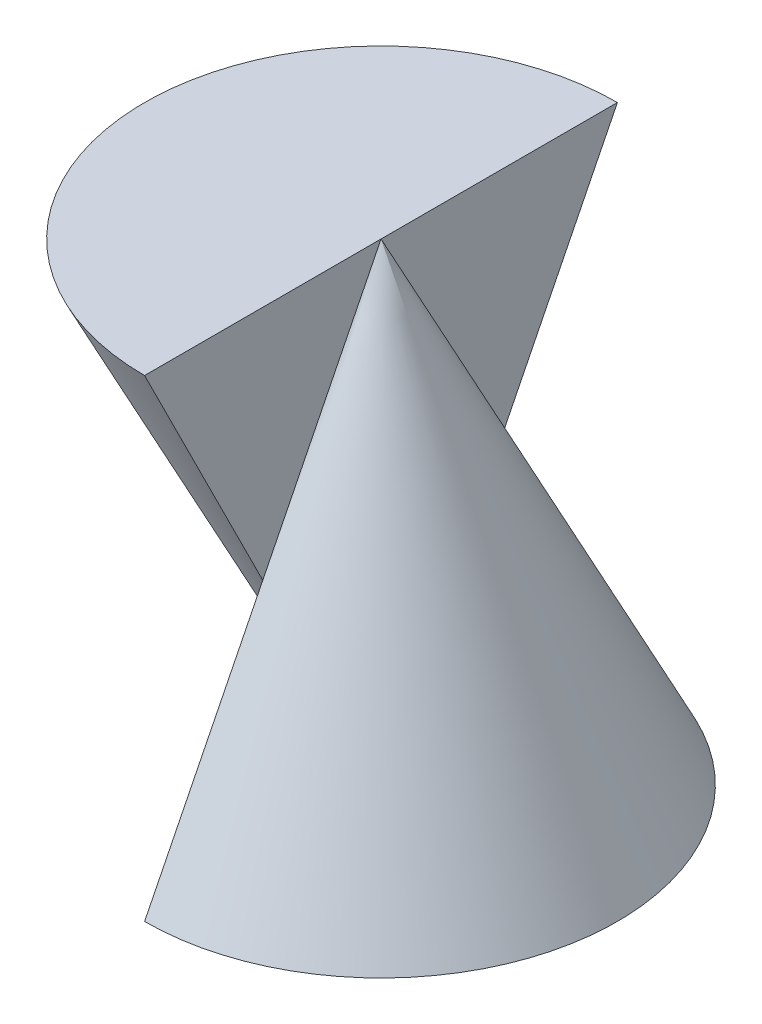
ISO-10303-21;
HEADER;
FILE_DESCRIPTION(('STEP AP214'),'2;1');
FILE_NAME('part.step','',(''),(''),'','','');
FILE_SCHEMA(('AUTOMOTIVE_DESIGN { 1 0 10303 214 1 1 1 1 }'));
ENDSEC;
DATA;
#1=APPLICATION_CONTEXT('core data for automotive mechanical design processes');
#2=APPLICATION_PROTOCOL_DEFINITION('international standard','automotive_design',2000,#1);
#3=PRODUCT_CONTEXT('',#1,'mechanical');
#4=PRODUCT('Part','Part','',(#3));
#5=PRODUCT_RELATED_PRODUCT_CATEGORY('part','',(#4));
#6=PRODUCT_DEFINITION_FORMATION('','',#4);
#7=PRODUCT_DEFINITION_CONTEXT('part definition',#1,'design');
#8=PRODUCT_DEFINITION('design','',#6,#7);
#9=PRODUCT_DEFINITION_SHAPE('','',#8);
#10=(LENGTH_UNIT() NAMED_UNIT(*) SI_UNIT(.MILLI.,.METRE.));
#11=(NAMED_UNIT(*) PLANE_ANGLE_UNIT() SI_UNIT($,.RADIAN.));
#12=(NAMED_UNIT(*) SI_UNIT($,.STERADIAN.) SOLID_ANGLE_UNIT());
#13=UNCERTAINTY_MEASURE_WITH_UNIT(LENGTH_MEASURE(1.E-05),#10,'distance_accuracy_value','');
#14=(GEOMETRIC_REPRESENTATION_CONTEXT(3) GLOBAL_UNCERTAINTY_ASSIGNED_CONTEXT((#13)) GLOBAL_UNIT_ASSIGNED_CONTEXT((#10,
#11,#12)) REPRESENTATION_CONTEXT('',''));
#15=CARTESIAN_POINT('',(0.,0.,0.));
#16=DIRECTION('',(0.,0.,1.));
#17=DIRECTION('',(1.,0.,0.));
#18=AXIS2_PLACEMENT_3D('',#15,#16,#17);
#19=CARTESIAN_POINT('',(0.,0.,0.));
#20=DIRECTION('',(-1.,0.,0.));
#21=DIRECTION('',(0.,0.,1.));
#22=AXIS2_PLACEMENT_3D('',#19,#20,#21);
#23=PLANE('',#22);
#24=DIRECTION('',(0.,-0.894427190999916,0.447213595499958));
#25=VECTOR('',#24,1.);
#26=CARTESIAN_POINT('',(0.,4.,0.));
#27=LINE('',#26,#25);
#28=CARTESIAN_POINT('',(0.,2.,1.));
#29=VERTEX_POINT('',#28);
#30=CARTESIAN_POINT('',(0.,0.,2.));
#31=VERTEX_POINT('',#30);
#32=EDGE_CURVE('E96',#29,#31,#27,.T.);
#33=ORIENTED_EDGE('',*,*,#32,.F.);
#34=DIRECTION('',(0.,0.894427190999916,0.447213595499958));
#35=VECTOR('',#34,1.);
#36=CARTESIAN_POINT('',(0.,4.,2.));
#37=LINE('',#36,#35);
#38=CARTESIAN_POINT('',(0.,0.,0.));
#39=VERTEX_POINT('',#38);
#40=EDGE_CURVE('E92',#39,#29,#37,.T.);
#41=ORIENTED_EDGE('',*,*,#40,.F.);
#42=DIRECTION('',(0.,0.,1.));
#43=VECTOR('',#42,1.);
#44=CARTESIAN_POINT('',(0.,0.,-2.));
#45=LINE('',#44,#43);
#46=EDGE_CURVE('E102',#39,#31,#45,.T.);
#47=ORIENTED_EDGE('',*,*,#46,.T.);
#48=EDGE_LOOP('',(#33,#41,#47));
#49=FACE_BOUND('',#48,.T.);
#50=ADVANCED_FACE('F33',(#49),#23,.T.);
#51=CARTESIAN_POINT('',(0.,0.,-2.));
#52=VERTEX_POINT('',#51);
#53=EDGE_CURVE('E41',#52,#39,#45,.T.);
#54=ORIENTED_EDGE('',*,*,#53,.T.);
#55=DIRECTION('',(0.,0.894427190999916,-0.447213595499958));
#56=VECTOR('',#55,1.);
#57=CARTESIAN_POINT('',(0.,4.,-2.));
#58=LINE('',#57,#56);
#59=CARTESIAN_POINT('',(0.,2.,-1.));
#60=VERTEX_POINT('',#59);
#61=EDGE_CURVE('E87',#39,#60,#58,.T.);
#62=ORIENTED_EDGE('',*,*,#61,.T.);
#63=DIRECTION('',(0.,-0.894427190999916,-0.447213595499958));
#64=VECTOR('',#63,1.);
#65=CARTESIAN_POINT('',(0.,4.,0.));
#66=LINE('',#65,#64);
#67=EDGE_CURVE('E56',#60,#52,#66,.T.);
#68=ORIENTED_EDGE('',*,*,#67,.T.);
#69=EDGE_LOOP('',(#54,#62,#68));
#70=FACE_BOUND('',#69,.T.);
#71=ADVANCED_FACE('F113',(#70),#23,.T.);
#72=CARTESIAN_POINT('',(0.,4.,0.));
#73=DIRECTION('',(0.,-1.,0.));
#74=DIRECTION('',(0.,0.,-1.));
#75=AXIS2_PLACEMENT_3D('',#72,#73,#74);
#76=CONICAL_SURFACE('',#75,0.,0.463647609000806);
#77=CARTESIAN_POINT('',(0.,0.,0.));
#78=DIRECTION('',(0.,-1.,0.));
#79=DIRECTION('',(0.,0.,-1.));
#80=AXIS2_PLACEMENT_3D('',#77,#78,#79);
#81=CIRCLE('',#80,2.);
#82=EDGE_CURVE('E11',#52,#31,#81,.T.);
#83=ORIENTED_EDGE('',*,*,#82,.F.);
#84=ORIENTED_EDGE('',*,*,#67,.F.);
#85=CARTESIAN_POINT('',(0.,4.,0.));
#86=VERTEX_POINT('',#85);
#87=EDGE_CURVE('E101',#86,#60,#66,.T.);
#88=ORIENTED_EDGE('',*,*,#87,.F.);
#89=EDGE_CURVE('E81',#86,#29,#27,.T.);
#90=ORIENTED_EDGE('',*,*,#89,.T.);
#91=ORIENTED_EDGE('',*,*,#32,.T.);
#92=EDGE_LOOP('',(#83,#84,#88,#90,#91));
#93=FACE_BOUND('',#92,.T.);
#94=ADVANCED_FACE('F35',(#93),#76,.T.);
#95=CARTESIAN_POINT('',(0.,0.,-2.));
#96=DIRECTION('',(0.,1.,0.));
#97=DIRECTION('',(0.,0.,1.));
#98=AXIS2_PLACEMENT_3D('',#95,#96,#97);
#99=PLANE('',#98);
#100=ORIENTED_EDGE('',*,*,#53,.F.);
#101=ORIENTED_EDGE('',*,*,#82,.T.);
#102=ORIENTED_EDGE('',*,*,#46,.F.);
#103=EDGE_LOOP('',(#100,#101,#102));
#104=FACE_BOUND('',#103,.T.);
#105=ADVANCED_FACE('F108',(#104),#99,.F.);
#106=CARTESIAN_POINT('',(0.,0.,0.));
#107=DIRECTION('',(-1.,0.,0.));
#108=DIRECTION('',(0.,0.,1.));
#109=AXIS2_PLACEMENT_3D('',#106,#107,#108);
#110=PLANE('',#109);
#111=DIRECTION('',(0.,0.,1.));
#112=VECTOR('',#111,1.);
#113=CARTESIAN_POINT('',(0.,4.,0.));
#114=LINE('',#113,#112);
#115=CARTESIAN_POINT('',(0.,4.,-2.));
#116=VERTEX_POINT('',#115);
#117=EDGE_CURVE('E86',#116,#86,#114,.T.);
#118=ORIENTED_EDGE('',*,*,#117,.T.);
#119=ORIENTED_EDGE('',*,*,#87,.T.);
#120=EDGE_CURVE('E48',#60,#116,#58,.T.);
#121=ORIENTED_EDGE('',*,*,#120,.T.);
#122=EDGE_LOOP('',(#118,#119,#121));
#123=FACE_BOUND('',#122,.T.);
#124=ADVANCED_FACE('F112',(#123),#110,.F.);
#125=CARTESIAN_POINT('',(0.,4.,2.));
#126=VERTEX_POINT('',#125);
#127=EDGE_CURVE('E78',#29,#126,#37,.T.);
#128=ORIENTED_EDGE('',*,*,#127,.F.);
#129=ORIENTED_EDGE('',*,*,#89,.F.);
#130=EDGE_CURVE('E75',#86,#126,#114,.T.);
#131=ORIENTED_EDGE('',*,*,#130,.T.);
#132=EDGE_LOOP('',(#128,#129,#131));
#133=FACE_BOUND('',#132,.T.);
#134=ADVANCED_FACE('F77',(#133),#110,.F.);
#135=CARTESIAN_POINT('',(0.,4.,0.));
#136=DIRECTION('',(0.,-1.,0.));
#137=DIRECTION('',(0.,0.,-1.));
#138=AXIS2_PLACEMENT_3D('',#135,#136,#137);
#139=PLANE('',#138);
#140=CARTESIAN_POINT('',(0.,4.,0.));
#141=DIRECTION('',(0.,1.,0.));
#142=DIRECTION('',(0.,0.,1.));
#143=AXIS2_PLACEMENT_3D('',#140,#141,#142);
#144=CIRCLE('',#143,2.);
#145=EDGE_CURVE('E90',#116,#126,#144,.T.);
#146=ORIENTED_EDGE('',*,*,#145,.T.);
#147=ORIENTED_EDGE('',*,*,#130,.F.);
#148=ORIENTED_EDGE('',*,*,#117,.F.);
#149=EDGE_LOOP('',(#146,#147,#148));
#150=FACE_BOUND('',#149,.T.);
#151=ADVANCED_FACE('F95',(#150),#139,.F.);
#152=CARTESIAN_POINT('',(0.,0.,0.));
#153=DIRECTION('',(0.,1.,0.));
#154=DIRECTION('',(0.,0.,1.));
#155=AXIS2_PLACEMENT_3D('',#152,#153,#154);
#156=CONICAL_SURFACE('',#155,0.,0.463647609000806);
#157=ORIENTED_EDGE('',*,*,#61,.F.);
#158=ORIENTED_EDGE('',*,*,#40,.T.);
#159=ORIENTED_EDGE('',*,*,#127,.T.);
#160=ORIENTED_EDGE('',*,*,#145,.F.);
#161=ORIENTED_EDGE('',*,*,#120,.F.);
#162=EDGE_LOOP('',(#157,#158,#159,#160,#161));
#163=FACE_BOUND('',#162,.T.);
#164=ADVANCED_FACE('F89',(#163),#156,.T.);
#165=CLOSED_SHELL('',(#50,#71,#94,#105,#124,#134,#151,#164));
#166=MANIFOLD_SOLID_BREP('B2',#165);
#167=ADVANCED_BREP_SHAPE_REPRESENTATION('',(#18,#166),#14);
#168=SHAPE_DEFINITION_REPRESENTATION(#9,#167);
ENDSEC;
END-ISO-10303-21;
